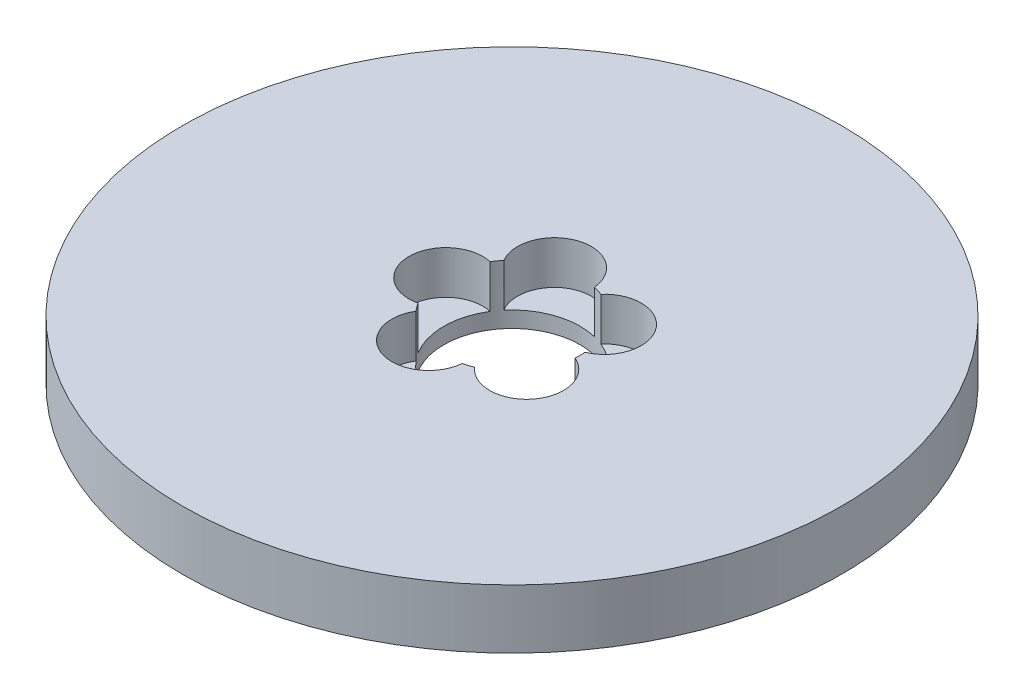
ISO-10303-21;
HEADER;
FILE_DESCRIPTION(('STEP AP214'),'2;1');
FILE_NAME('part.step','',(''),(''),'','','');
FILE_SCHEMA(('AUTOMOTIVE_DESIGN { 1 0 10303 214 1 1 1 1 }'));
ENDSEC;
DATA;
#1=APPLICATION_CONTEXT('core data for automotive mechanical design processes');
#2=APPLICATION_PROTOCOL_DEFINITION('international standard','automotive_design',2000,#1);
#3=PRODUCT_CONTEXT('',#1,'mechanical');
#4=PRODUCT('Part','Part','',(#3));
#5=PRODUCT_RELATED_PRODUCT_CATEGORY('part','',(#4));
#6=PRODUCT_DEFINITION_FORMATION('','',#4);
#7=PRODUCT_DEFINITION_CONTEXT('part definition',#1,'design');
#8=PRODUCT_DEFINITION('design','',#6,#7);
#9=PRODUCT_DEFINITION_SHAPE('','',#8);
#10=(LENGTH_UNIT() NAMED_UNIT(*) SI_UNIT(.MILLI.,.METRE.));
#11=(NAMED_UNIT(*) PLANE_ANGLE_UNIT() SI_UNIT($,.RADIAN.));
#12=(NAMED_UNIT(*) SI_UNIT($,.STERADIAN.) SOLID_ANGLE_UNIT());
#13=UNCERTAINTY_MEASURE_WITH_UNIT(LENGTH_MEASURE(1.E-05),#10,'distance_accuracy_value','');
#14=(GEOMETRIC_REPRESENTATION_CONTEXT(3) GLOBAL_UNCERTAINTY_ASSIGNED_CONTEXT((#13)) GLOBAL_UNIT_ASSIGNED_CONTEXT((#10,
#11,#12)) REPRESENTATION_CONTEXT('',''));
#15=CARTESIAN_POINT('',(0.,0.,0.));
#16=DIRECTION('',(0.,0.,1.));
#17=DIRECTION('',(1.,0.,0.));
#18=AXIS2_PLACEMENT_3D('',#15,#16,#17);
#19=CARTESIAN_POINT('',(0.,13.,0.));
#20=DIRECTION('',(0.,-1.,0.));
#21=DIRECTION('',(0.,0.,-1.));
#22=AXIS2_PLACEMENT_3D('',#19,#20,#21);
#23=CYLINDRICAL_SURFACE('',#22,72.5);
#24=CARTESIAN_POINT('',(0.,13.,0.));
#25=DIRECTION('',(0.,1.,0.));
#26=DIRECTION('',(0.,0.,1.));
#27=AXIS2_PLACEMENT_3D('',#24,#25,#26);
#28=CIRCLE('',#27,72.5);
#29=CARTESIAN_POINT('',(0.,13.,-72.5));
#30=VERTEX_POINT('',#29);
#31=EDGE_CURVE('E157',#30,#30,#28,.T.);
#32=CARTESIAN_POINT('',(0.,0.,0.));
#33=DIRECTION('',(0.,1.,0.));
#34=DIRECTION('',(0.,0.,1.));
#35=AXIS2_PLACEMENT_3D('',#32,#33,#34);
#36=CIRCLE('',#35,72.5);
#37=CARTESIAN_POINT('',(0.,0.,-72.5));
#38=VERTEX_POINT('',#37);
#39=EDGE_CURVE('E150',#38,#38,#36,.T.);
#40=CARTESIAN_POINT('',(0.,13.,-72.5));
#41=CARTESIAN_POINT('',(0.,12.8645833333333,-72.5));
#42=CARTESIAN_POINT('',(0.,12.7291666666667,-72.5));
#43=CARTESIAN_POINT('',(0.,12.4583333333333,-72.5));
#44=CARTESIAN_POINT('',(0.,12.3229166666667,-72.5));
#45=CARTESIAN_POINT('',(0.,12.0520833333333,-72.5));
#46=CARTESIAN_POINT('',(0.,11.9166666666667,-72.5));
#47=CARTESIAN_POINT('',(0.,11.6458333333333,-72.5));
#48=CARTESIAN_POINT('',(0.,11.5104166666667,-72.5));
#49=CARTESIAN_POINT('',(0.,11.2395833333333,-72.5));
#50=CARTESIAN_POINT('',(0.,11.1041666666667,-72.5));
#51=CARTESIAN_POINT('',(0.,10.8333333333333,-72.5));
#52=CARTESIAN_POINT('',(0.,10.6979166666667,-72.5));
#53=CARTESIAN_POINT('',(0.,10.4270833333333,-72.5));
#54=CARTESIAN_POINT('',(0.,10.2916666666667,-72.5));
#55=CARTESIAN_POINT('',(0.,10.0208333333333,-72.5));
#56=CARTESIAN_POINT('',(0.,9.88541666666667,-72.5));
#57=CARTESIAN_POINT('',(0.,9.61458333333333,-72.5));
#58=CARTESIAN_POINT('',(0.,9.47916666666667,-72.5));
#59=CARTESIAN_POINT('',(0.,9.20833333333333,-72.5));
#60=CARTESIAN_POINT('',(0.,9.07291666666666,-72.5));
#61=CARTESIAN_POINT('',(0.,8.80208333333333,-72.5));
#62=CARTESIAN_POINT('',(0.,8.66666666666667,-72.5));
#63=CARTESIAN_POINT('',(0.,8.39583333333333,-72.5));
#64=CARTESIAN_POINT('',(0.,8.26041666666667,-72.5));
#65=CARTESIAN_POINT('',(0.,7.98958333333333,-72.5));
#66=CARTESIAN_POINT('',(0.,7.85416666666667,-72.5));
#67=CARTESIAN_POINT('',(0.,7.58333333333333,-72.5));
#68=CARTESIAN_POINT('',(0.,7.44791666666667,-72.5));
#69=CARTESIAN_POINT('',(0.,7.17708333333333,-72.5));
#70=CARTESIAN_POINT('',(0.,7.04166666666667,-72.5));
#71=CARTESIAN_POINT('',(0.,6.77083333333333,-72.5));
#72=CARTESIAN_POINT('',(0.,6.63541666666667,-72.5));
#73=CARTESIAN_POINT('',(0.,6.36458333333333,-72.5));
#74=CARTESIAN_POINT('',(0.,6.22916666666667,-72.5));
#75=CARTESIAN_POINT('',(0.,5.95833333333333,-72.5));
#76=CARTESIAN_POINT('',(0.,5.82291666666667,-72.5));
#77=CARTESIAN_POINT('',(0.,5.55208333333333,-72.5));
#78=CARTESIAN_POINT('',(0.,5.41666666666667,-72.5));
#79=CARTESIAN_POINT('',(0.,5.14583333333333,-72.5));
#80=CARTESIAN_POINT('',(0.,5.01041666666667,-72.5));
#81=CARTESIAN_POINT('',(0.,4.73958333333333,-72.5));
#82=CARTESIAN_POINT('',(0.,4.60416666666667,-72.5));
#83=CARTESIAN_POINT('',(0.,4.33333333333333,-72.5));
#84=CARTESIAN_POINT('',(0.,4.19791666666667,-72.5));
#85=CARTESIAN_POINT('',(0.,3.92708333333333,-72.5));
#86=CARTESIAN_POINT('',(0.,3.79166666666667,-72.5));
#87=CARTESIAN_POINT('',(0.,3.52083333333333,-72.5));
#88=CARTESIAN_POINT('',(0.,3.38541666666667,-72.5));
#89=CARTESIAN_POINT('',(0.,3.11458333333333,-72.5));
#90=CARTESIAN_POINT('',(0.,2.97916666666667,-72.5));
#91=CARTESIAN_POINT('',(0.,2.70833333333333,-72.5));
#92=CARTESIAN_POINT('',(0.,2.57291666666667,-72.5));
#93=CARTESIAN_POINT('',(0.,2.30208333333333,-72.5));
#94=CARTESIAN_POINT('',(0.,2.16666666666667,-72.5));
#95=CARTESIAN_POINT('',(0.,1.89583333333333,-72.5));
#96=CARTESIAN_POINT('',(0.,1.76041666666667,-72.5));
#97=CARTESIAN_POINT('',(0.,1.48958333333333,-72.5));
#98=CARTESIAN_POINT('',(0.,1.35416666666667,-72.5));
#99=CARTESIAN_POINT('',(0.,1.08333333333333,-72.5));
#100=CARTESIAN_POINT('',(0.,0.947916666666667,-72.5));
#101=CARTESIAN_POINT('',(0.,0.677083333333334,-72.5));
#102=CARTESIAN_POINT('',(0.,0.541666666666667,-72.5));
#103=CARTESIAN_POINT('',(0.,0.270833333333334,-72.5));
#104=CARTESIAN_POINT('',(0.,0.135416666666667,-72.5));
#105=CARTESIAN_POINT('',(0.,0.,-72.5));
#106=B_SPLINE_CURVE_WITH_KNOTS('',3,(#40,#41,#42,#43,#44,#45,#46,#47,#48,#49,#50,#51,#52,#53,
#54,#55,#56,#57,#58,#59,#60,#61,#62,#63,#64,#65,#66,#67,#68,#69,#70,#71,#72,#73,#74,#75,#76,#77,
#78,#79,#80,#81,#82,#83,#84,#85,#86,#87,#88,#89,#90,#91,#92,#93,#94,#95,#96,#97,#98,#99,#100,
#101,#102,#103,#104,#105),.UNSPECIFIED.,.F.,.F.,(4,2,2,2,2,2,2,2,2,2,2,2,2,2,2,2,2,2,2,2,2,2,2,
2,2,2,2,2,2,2,2,2,4),(0.,0.40625,0.812500000000001,1.21875,1.625,2.03125,2.4375,2.84375,3.25,
3.65625,4.0625,4.46875,4.875,5.28125,5.6875,6.09375,6.5,6.90625,7.3125,7.71875,8.125,8.53125,
8.9375,9.34375,9.75,10.15625,10.5625,10.96875,11.375,11.78125,12.1875,12.59375,13.),.UNSPECIFIED.);
#107=EDGE_CURVE('BSEAM39',#30,#38,#106,.T.);
#108=ORIENTED_EDGE('',*,*,#31,.F.);
#109=ORIENTED_EDGE('',*,*,#39,.T.);
#110=ORIENTED_EDGE('',*,*,#107,.T.);
#111=ORIENTED_EDGE('',*,*,#107,.F.);
#112=EDGE_LOOP('',(#108,#110,#109,#111));
#113=FACE_BOUND('',#112,.T.);
#114=ADVANCED_FACE('F39',(#113),#23,.T.);
#115=CARTESIAN_POINT('',(0.,13.,0.));
#116=DIRECTION('',(0.,1.,0.));
#117=DIRECTION('',(0.,0.,1.));
#118=AXIS2_PLACEMENT_3D('',#115,#116,#117);
#119=PLANE('',#118);
#120=CARTESIAN_POINT('',(-4.49469762514531,13.,-13.8332568854899));
#121=DIRECTION('',(0.,1.,0.));
#122=DIRECTION('',(-0.95105651629515,0.,0.309016994374958));
#123=AXIS2_PLACEMENT_3D('',#120,#121,#122);
#124=CIRCLE('',#123,8.11849038893925);
#125=CARTESIAN_POINT('',(3.59085227778288,13.,-14.5638518228916));
#126=VERTEX_POINT('',#125);
#127=CARTESIAN_POINT('',(-11.4654778350851,13.,-9.67175361623595));
#128=VERTEX_POINT('',#127);
#129=EDGE_CURVE('E194',#126,#128,#124,.T.);
#130=ORIENTED_EDGE('',*,*,#129,.F.);
#131=CARTESIAN_POINT('',(0.,13.,0.));
#132=DIRECTION('',(0.,1.,0.));
#133=DIRECTION('',(0.,0.,1.));
#134=AXIS2_PLACEMENT_3D('',#131,#132,#133);
#135=CIRCLE('',#134,15.);
#136=CARTESIAN_POINT('',(5.65535680105188,13.,-13.8930536403195));
#137=VERTEX_POINT('',#136);
#138=EDGE_CURVE('E147',#137,#126,#135,.T.);
#139=ORIENTED_EDGE('',*,*,#138,.F.);
#140=CARTESIAN_POINT('',(11.7672711517834,13.,-8.54942293034139));
#141=DIRECTION('',(0.,1.,0.));
#142=DIRECTION('',(-0.58778525229248,0.,-0.809016994374942));
#143=AXIS2_PLACEMENT_3D('',#140,#141,#142);
#144=CIRCLE('',#143,8.11849038893925);
#145=CARTESIAN_POINT('',(14.960680556643,13.,-1.0853742589933));
#146=VERTEX_POINT('',#145);
#147=EDGE_CURVE('E254',#146,#137,#144,.T.);
#148=ORIENTED_EDGE('',*,*,#147,.F.);
#149=CARTESIAN_POINT('',(14.960680556643,13.,1.08537425899308));
#150=VERTEX_POINT('',#149);
#151=EDGE_CURVE('E144',#150,#146,#135,.T.);
#152=ORIENTED_EDGE('',*,*,#151,.F.);
#153=CARTESIAN_POINT('',(11.7672711517835,13.,8.54942293034122));
#154=DIRECTION('',(0.,1.,0.));
#155=DIRECTION('',(0.587785252292469,0.,-0.809016994374951));
#156=AXIS2_PLACEMENT_3D('',#153,#154,#155);
#157=CIRCLE('',#156,8.11849038893925);
#158=CARTESIAN_POINT('',(5.65535680105208,13.,13.8930536403195));
#159=VERTEX_POINT('',#158);
#160=EDGE_CURVE('E141',#159,#150,#157,.T.);
#161=ORIENTED_EDGE('',*,*,#160,.F.);
#162=CARTESIAN_POINT('',(3.59085227778309,13.,14.5638518228915));
#163=VERTEX_POINT('',#162);
#164=EDGE_CURVE('E134',#163,#159,#135,.T.);
#165=ORIENTED_EDGE('',*,*,#164,.F.);
#166=CARTESIAN_POINT('',(-4.49469762514511,13.,13.8332568854899));
#167=DIRECTION('',(0.,1.,0.));
#168=DIRECTION('',(0.951056516295155,0.,0.309016994374945));
#169=AXIS2_PLACEMENT_3D('',#166,#167,#168);
#170=CIRCLE('',#169,8.11849038893925);
#171=CARTESIAN_POINT('',(-11.4654778350849,13.,9.67175361623611));
#172=VERTEX_POINT('',#171);
#173=EDGE_CURVE('E111',#172,#163,#170,.T.);
#174=ORIENTED_EDGE('',*,*,#173,.F.);
#175=CARTESIAN_POINT('',(-12.7414118003931,13.,7.9155811746709));
#176=VERTEX_POINT('',#175);
#177=EDGE_CURVE('E145',#176,#172,#135,.T.);
#178=ORIENTED_EDGE('',*,*,#177,.F.);
#179=CARTESIAN_POINT('',(-14.5451470532766,13.,0.));
#180=DIRECTION('',(0.,1.,0.));
#181=DIRECTION('',(0.,0.,1.));
#182=AXIS2_PLACEMENT_3D('',#179,#180,#181);
#183=CIRCLE('',#182,8.11849038893925);
#184=CARTESIAN_POINT('',(-12.7414118003931,13.,-7.9155811746709));
#185=VERTEX_POINT('',#184);
#186=EDGE_CURVE('E153',#185,#176,#183,.T.);
#187=ORIENTED_EDGE('',*,*,#186,.F.);
#188=EDGE_CURVE('E146',#128,#185,#135,.T.);
#189=ORIENTED_EDGE('',*,*,#188,.F.);
#190=EDGE_LOOP('',(#130,#139,#148,#152,#161,#165,#174,#178,#187,#189));
#191=FACE_BOUND('',#190,.T.);
#192=ORIENTED_EDGE('',*,*,#31,.T.);
#193=EDGE_LOOP('',(#192));
#194=FACE_BOUND('',#193,.T.);
#195=ADVANCED_FACE('F139',(#191,#194),#119,.T.);
#196=CARTESIAN_POINT('',(0.,0.,0.));
#197=DIRECTION('',(0.,1.,0.));
#198=DIRECTION('',(0.,0.,1.));
#199=AXIS2_PLACEMENT_3D('',#196,#197,#198);
#200=PLANE('',#199);
#201=CARTESIAN_POINT('',(0.,0.,0.));
#202=DIRECTION('',(0.,1.,0.));
#203=DIRECTION('',(0.,0.,1.));
#204=AXIS2_PLACEMENT_3D('',#201,#202,#203);
#205=CIRCLE('',#204,15.);
#206=CARTESIAN_POINT('',(0.,0.,15.));
#207=VERTEX_POINT('',#206);
#208=EDGE_CURVE('E154',#207,#207,#205,.T.);
#209=ORIENTED_EDGE('',*,*,#208,.T.);
#210=EDGE_LOOP('',(#209));
#211=FACE_BOUND('',#210,.T.);
#212=ORIENTED_EDGE('',*,*,#39,.F.);
#213=EDGE_LOOP('',(#212));
#214=FACE_BOUND('',#213,.T.);
#215=ADVANCED_FACE('F213',(#211,#214),#200,.F.);
#216=CARTESIAN_POINT('',(0.,13.,0.));
#217=DIRECTION('',(0.,-1.,0.));
#218=DIRECTION('',(0.,0.,-1.));
#219=AXIS2_PLACEMENT_3D('',#216,#217,#218);
#220=CYLINDRICAL_SURFACE('',#219,15.);
#221=DIRECTION('',(0.,1.,0.));
#222=VECTOR('',#221,1.);
#223=CARTESIAN_POINT('',(3.59085227778288,8.26298259998294,-14.5638518228915));
#224=LINE('',#223,#222);
#225=CARTESIAN_POINT('',(3.59085227778288,3.52596519996587,-14.5638518228916));
#226=VERTEX_POINT('',#225);
#227=EDGE_CURVE('E11',#226,#126,#224,.T.);
#228=ORIENTED_EDGE('',*,*,#227,.F.);
#229=CARTESIAN_POINT('',(0.,3.52596519996587,0.));
#230=DIRECTION('',(0.,1.,0.));
#231=DIRECTION('',(0.,0.,1.));
#232=AXIS2_PLACEMENT_3D('',#229,#230,#231);
#233=CIRCLE('',#232,15.);
#234=CARTESIAN_POINT('',(-11.4654778350851,3.52596519996587,-9.67175361623595));
#235=VERTEX_POINT('',#234);
#236=EDGE_CURVE('E189',#226,#235,#233,.T.);
#237=ORIENTED_EDGE('',*,*,#236,.T.);
#238=DIRECTION('',(0.,1.,0.));
#239=VECTOR('',#238,1.);
#240=CARTESIAN_POINT('',(-11.4654778350851,8.26298259998294,-9.67175361623594));
#241=LINE('',#240,#239);
#242=EDGE_CURVE('E46',#128,#235,#241,.F.);
#243=ORIENTED_EDGE('',*,*,#242,.F.);
#244=ORIENTED_EDGE('',*,*,#188,.T.);
#245=DIRECTION('',(0.,1.,0.));
#246=VECTOR('',#245,1.);
#247=CARTESIAN_POINT('',(-12.7414118003931,8.26298259998294,-7.9155811746709));
#248=LINE('',#247,#246);
#249=CARTESIAN_POINT('',(-12.7414118003931,3.52596519996587,-7.9155811746709));
#250=VERTEX_POINT('',#249);
#251=EDGE_CURVE('E168',#250,#185,#248,.T.);
#252=ORIENTED_EDGE('',*,*,#251,.F.);
#253=CARTESIAN_POINT('',(0.,3.52596519996587,0.));
#254=DIRECTION('',(0.,1.,0.));
#255=DIRECTION('',(0.,0.,1.));
#256=AXIS2_PLACEMENT_3D('',#253,#254,#255);
#257=CIRCLE('',#256,15.);
#258=CARTESIAN_POINT('',(-12.7414118003931,3.52596519996587,7.9155811746709));
#259=VERTEX_POINT('',#258);
#260=EDGE_CURVE('E165',#250,#259,#257,.T.);
#261=ORIENTED_EDGE('',*,*,#260,.T.);
#262=DIRECTION('',(0.,1.,0.));
#263=VECTOR('',#262,1.);
#264=CARTESIAN_POINT('',(-12.7414118003931,8.26298259998294,7.9155811746709));
#265=LINE('',#264,#263);
#266=EDGE_CURVE('E170',#176,#259,#265,.F.);
#267=ORIENTED_EDGE('',*,*,#266,.F.);
#268=ORIENTED_EDGE('',*,*,#177,.T.);
#269=DIRECTION('',(0.,1.,0.));
#270=VECTOR('',#269,1.);
#271=CARTESIAN_POINT('',(-11.4654778350849,8.26298259998294,9.67175361623611));
#272=LINE('',#271,#270);
#273=CARTESIAN_POINT('',(-11.4654778350849,3.52596519996587,9.67175361623611));
#274=VERTEX_POINT('',#273);
#275=EDGE_CURVE('E121',#274,#172,#272,.T.);
#276=ORIENTED_EDGE('',*,*,#275,.F.);
#277=CARTESIAN_POINT('',(0.,3.52596519996587,0.));
#278=DIRECTION('',(0.,1.,0.));
#279=DIRECTION('',(0.,0.,1.));
#280=AXIS2_PLACEMENT_3D('',#277,#278,#279);
#281=CIRCLE('',#280,15.);
#282=CARTESIAN_POINT('',(3.59085227778309,3.52596519996587,14.5638518228915));
#283=VERTEX_POINT('',#282);
#284=EDGE_CURVE('E136',#274,#283,#281,.T.);
#285=ORIENTED_EDGE('',*,*,#284,.T.);
#286=DIRECTION('',(0.,1.,0.));
#287=VECTOR('',#286,1.);
#288=CARTESIAN_POINT('',(3.59085227778309,8.26298259998294,14.5638518228915));
#289=LINE('',#288,#287);
#290=EDGE_CURVE('E117',#163,#283,#289,.F.);
#291=ORIENTED_EDGE('',*,*,#290,.F.);
#292=ORIENTED_EDGE('',*,*,#164,.T.);
#293=DIRECTION('',(0.,1.,0.));
#294=VECTOR('',#293,1.);
#295=CARTESIAN_POINT('',(5.65535680105208,8.26298259998294,13.8930536403195));
#296=LINE('',#295,#294);
#297=CARTESIAN_POINT('',(5.65535680105208,3.52596519996587,13.8930536403195));
#298=VERTEX_POINT('',#297);
#299=EDGE_CURVE('E182',#298,#159,#296,.T.);
#300=ORIENTED_EDGE('',*,*,#299,.F.);
#301=CARTESIAN_POINT('',(0.,3.52596519996587,0.));
#302=DIRECTION('',(0.,1.,0.));
#303=DIRECTION('',(0.,0.,1.));
#304=AXIS2_PLACEMENT_3D('',#301,#302,#303);
#305=CIRCLE('',#304,15.);
#306=CARTESIAN_POINT('',(14.960680556643,3.52596519996587,1.08537425899308));
#307=VERTEX_POINT('',#306);
#308=EDGE_CURVE('E174',#298,#307,#305,.T.);
#309=ORIENTED_EDGE('',*,*,#308,.T.);
#310=DIRECTION('',(0.,1.,0.));
#311=VECTOR('',#310,1.);
#312=CARTESIAN_POINT('',(14.960680556643,8.26298259998294,1.08537425899308));
#313=LINE('',#312,#311);
#314=EDGE_CURVE('E177',#150,#307,#313,.F.);
#315=ORIENTED_EDGE('',*,*,#314,.F.);
#316=ORIENTED_EDGE('',*,*,#151,.T.);
#317=DIRECTION('',(0.,1.,0.));
#318=VECTOR('',#317,1.);
#319=CARTESIAN_POINT('',(14.960680556643,8.26298259998294,-1.0853742589933));
#320=LINE('',#319,#318);
#321=CARTESIAN_POINT('',(14.960680556643,3.52596519996587,-1.0853742589933));
#322=VERTEX_POINT('',#321);
#323=EDGE_CURVE('E187',#322,#146,#320,.T.);
#324=ORIENTED_EDGE('',*,*,#323,.F.);
#325=CARTESIAN_POINT('',(0.,3.52596519996587,0.));
#326=DIRECTION('',(0.,1.,0.));
#327=DIRECTION('',(0.,0.,1.));
#328=AXIS2_PLACEMENT_3D('',#325,#326,#327);
#329=CIRCLE('',#328,15.);
#330=CARTESIAN_POINT('',(5.65535680105188,3.52596519996587,-13.8930536403195));
#331=VERTEX_POINT('',#330);
#332=EDGE_CURVE('E181',#322,#331,#329,.T.);
#333=ORIENTED_EDGE('',*,*,#332,.T.);
#334=DIRECTION('',(0.,1.,0.));
#335=VECTOR('',#334,1.);
#336=CARTESIAN_POINT('',(5.65535680105188,8.26298259998294,-13.8930536403196));
#337=LINE('',#336,#335);
#338=EDGE_CURVE('E186',#137,#331,#337,.F.);
#339=ORIENTED_EDGE('',*,*,#338,.F.);
#340=ORIENTED_EDGE('',*,*,#138,.T.);
#341=EDGE_LOOP('',(#228,#237,#243,#244,#252,#261,#267,#268,#276,#285,#291,#292,#300,#309,#315,
#316,#324,#333,#339,#340));
#342=FACE_BOUND('',#341,.T.);
#343=ORIENTED_EDGE('',*,*,#208,.F.);
#344=EDGE_LOOP('',(#343));
#345=FACE_BOUND('',#344,.T.);
#346=ADVANCED_FACE('F135',(#342,#345),#220,.F.);
#347=CARTESIAN_POINT('',(-14.5451470532766,3.52596519996587,0.));
#348=DIRECTION('',(0.,1.,0.));
#349=DIRECTION('',(0.,0.,1.));
#350=AXIS2_PLACEMENT_3D('',#347,#348,#349);
#351=CYLINDRICAL_SURFACE('',#350,8.11849038893925);
#352=ORIENTED_EDGE('',*,*,#251,.T.);
#353=ORIENTED_EDGE('',*,*,#186,.T.);
#354=ORIENTED_EDGE('',*,*,#266,.T.);
#355=CARTESIAN_POINT('',(-14.5451470532766,3.52596519996587,0.));
#356=DIRECTION('',(0.,1.,0.));
#357=DIRECTION('',(0.,0.,1.));
#358=AXIS2_PLACEMENT_3D('',#355,#356,#357);
#359=CIRCLE('',#358,8.11849038893925);
#360=EDGE_CURVE('E158',#250,#259,#359,.T.);
#361=ORIENTED_EDGE('',*,*,#360,.F.);
#362=EDGE_LOOP('',(#352,#353,#354,#361));
#363=FACE_BOUND('',#362,.T.);
#364=ADVANCED_FACE('F221',(#363),#351,.F.);
#365=CARTESIAN_POINT('',(-14.5451470532766,3.52596519996587,0.));
#366=DIRECTION('',(0.,1.,0.));
#367=DIRECTION('',(0.,0.,1.));
#368=AXIS2_PLACEMENT_3D('',#365,#366,#367);
#369=PLANE('',#368);
#370=ORIENTED_EDGE('',*,*,#360,.T.);
#371=ORIENTED_EDGE('',*,*,#260,.F.);
#372=EDGE_LOOP('',(#370,#371));
#373=FACE_BOUND('',#372,.T.);
#374=ADVANCED_FACE('F227',(#373),#369,.T.);
#375=CARTESIAN_POINT('',(-4.49469762514511,3.52596519996587,13.8332568854899));
#376=DIRECTION('',(0.,1.,0.));
#377=DIRECTION('',(0.,0.,1.));
#378=AXIS2_PLACEMENT_3D('',#375,#376,#377);
#379=CYLINDRICAL_SURFACE('',#378,8.11849038893925);
#380=ORIENTED_EDGE('',*,*,#275,.T.);
#381=ORIENTED_EDGE('',*,*,#173,.T.);
#382=ORIENTED_EDGE('',*,*,#290,.T.);
#383=CARTESIAN_POINT('',(-4.49469762514511,3.52596519996587,13.8332568854899));
#384=DIRECTION('',(0.,1.,0.));
#385=DIRECTION('',(0.951056516295155,0.,0.309016994374945));
#386=AXIS2_PLACEMENT_3D('',#383,#384,#385);
#387=CIRCLE('',#386,8.11849038893925);
#388=EDGE_CURVE('E127',#274,#283,#387,.T.);
#389=ORIENTED_EDGE('',*,*,#388,.F.);
#390=EDGE_LOOP('',(#380,#381,#382,#389));
#391=FACE_BOUND('',#390,.T.);
#392=ADVANCED_FACE('F116',(#391),#379,.F.);
#393=CARTESIAN_POINT('',(-4.49469762514511,3.52596519996587,13.8332568854899));
#394=DIRECTION('',(0.,1.,0.));
#395=DIRECTION('',(0.951056516295155,0.,0.309016994374945));
#396=AXIS2_PLACEMENT_3D('',#393,#394,#395);
#397=PLANE('',#396);
#398=ORIENTED_EDGE('',*,*,#388,.T.);
#399=ORIENTED_EDGE('',*,*,#284,.F.);
#400=EDGE_LOOP('',(#398,#399));
#401=FACE_BOUND('',#400,.T.);
#402=ADVANCED_FACE('F234',(#401),#397,.T.);
#403=CARTESIAN_POINT('',(11.7672711517835,3.52596519996587,8.54942293034122));
#404=DIRECTION('',(0.,1.,0.));
#405=DIRECTION('',(0.,0.,1.));
#406=AXIS2_PLACEMENT_3D('',#403,#404,#405);
#407=CYLINDRICAL_SURFACE('',#406,8.11849038893925);
#408=ORIENTED_EDGE('',*,*,#299,.T.);
#409=ORIENTED_EDGE('',*,*,#160,.T.);
#410=ORIENTED_EDGE('',*,*,#314,.T.);
#411=CARTESIAN_POINT('',(11.7672711517835,3.52596519996587,8.54942293034122));
#412=DIRECTION('',(0.,1.,0.));
#413=DIRECTION('',(0.587785252292469,0.,-0.809016994374951));
#414=AXIS2_PLACEMENT_3D('',#411,#412,#413);
#415=CIRCLE('',#414,8.11849038893925);
#416=EDGE_CURVE('E130',#298,#307,#415,.T.);
#417=ORIENTED_EDGE('',*,*,#416,.F.);
#418=EDGE_LOOP('',(#408,#409,#410,#417));
#419=FACE_BOUND('',#418,.T.);
#420=ADVANCED_FACE('F240',(#419),#407,.F.);
#421=CARTESIAN_POINT('',(11.7672711517835,3.52596519996587,8.54942293034122));
#422=DIRECTION('',(0.,1.,0.));
#423=DIRECTION('',(0.587785252292469,0.,-0.809016994374951));
#424=AXIS2_PLACEMENT_3D('',#421,#422,#423);
#425=PLANE('',#424);
#426=ORIENTED_EDGE('',*,*,#416,.T.);
#427=ORIENTED_EDGE('',*,*,#308,.F.);
#428=EDGE_LOOP('',(#426,#427));
#429=FACE_BOUND('',#428,.T.);
#430=ADVANCED_FACE('F245',(#429),#425,.T.);
#431=CARTESIAN_POINT('',(11.7672711517834,3.52596519996587,-8.54942293034139));
#432=DIRECTION('',(0.,1.,0.));
#433=DIRECTION('',(0.,0.,1.));
#434=AXIS2_PLACEMENT_3D('',#431,#432,#433);
#435=CYLINDRICAL_SURFACE('',#434,8.11849038893925);
#436=ORIENTED_EDGE('',*,*,#323,.T.);
#437=ORIENTED_EDGE('',*,*,#147,.T.);
#438=ORIENTED_EDGE('',*,*,#338,.T.);
#439=CARTESIAN_POINT('',(11.7672711517834,3.52596519996587,-8.54942293034139));
#440=DIRECTION('',(0.,1.,0.));
#441=DIRECTION('',(-0.58778525229248,0.,-0.809016994374942));
#442=AXIS2_PLACEMENT_3D('',#439,#440,#441);
#443=CIRCLE('',#442,8.11849038893925);
#444=EDGE_CURVE('E56',#322,#331,#443,.T.);
#445=ORIENTED_EDGE('',*,*,#444,.F.);
#446=EDGE_LOOP('',(#436,#437,#438,#445));
#447=FACE_BOUND('',#446,.T.);
#448=ADVANCED_FACE('F266',(#447),#435,.F.);
#449=CARTESIAN_POINT('',(11.7672711517834,3.52596519996587,-8.54942293034139));
#450=DIRECTION('',(0.,1.,0.));
#451=DIRECTION('',(-0.58778525229248,0.,-0.809016994374942));
#452=AXIS2_PLACEMENT_3D('',#449,#450,#451);
#453=PLANE('',#452);
#454=ORIENTED_EDGE('',*,*,#444,.T.);
#455=ORIENTED_EDGE('',*,*,#332,.F.);
#456=EDGE_LOOP('',(#454,#455));
#457=FACE_BOUND('',#456,.T.);
#458=ADVANCED_FACE('F204',(#457),#453,.T.);
#459=CARTESIAN_POINT('',(-4.49469762514531,3.52596519996587,-13.8332568854899));
#460=DIRECTION('',(0.,1.,0.));
#461=DIRECTION('',(0.,0.,1.));
#462=AXIS2_PLACEMENT_3D('',#459,#460,#461);
#463=CYLINDRICAL_SURFACE('',#462,8.11849038893925);
#464=ORIENTED_EDGE('',*,*,#227,.T.);
#465=ORIENTED_EDGE('',*,*,#129,.T.);
#466=ORIENTED_EDGE('',*,*,#242,.T.);
#467=CARTESIAN_POINT('',(-4.49469762514531,3.52596519996587,-13.8332568854899));
#468=DIRECTION('',(0.,1.,0.));
#469=DIRECTION('',(-0.95105651629515,0.,0.309016994374958));
#470=AXIS2_PLACEMENT_3D('',#467,#468,#469);
#471=CIRCLE('',#470,8.11849038893925);
#472=EDGE_CURVE('E55',#226,#235,#471,.T.);
#473=ORIENTED_EDGE('',*,*,#472,.F.);
#474=EDGE_LOOP('',(#464,#465,#466,#473));
#475=FACE_BOUND('',#474,.T.);
#476=ADVANCED_FACE('F193',(#475),#463,.F.);
#477=CARTESIAN_POINT('',(-4.49469762514531,3.52596519996587,-13.8332568854899));
#478=DIRECTION('',(0.,1.,0.));
#479=DIRECTION('',(-0.95105651629515,0.,0.309016994374958));
#480=AXIS2_PLACEMENT_3D('',#477,#478,#479);
#481=PLANE('',#480);
#482=ORIENTED_EDGE('',*,*,#472,.T.);
#483=ORIENTED_EDGE('',*,*,#236,.F.);
#484=EDGE_LOOP('',(#482,#483));
#485=FACE_BOUND('',#484,.T.);
#486=ADVANCED_FACE('F196',(#485),#481,.T.);
#487=CLOSED_SHELL('',(#114,#195,#215,#346,#364,#374,#392,#402,#420,#430,#448,#458,#476,#486));
#488=MANIFOLD_SOLID_BREP('B2',#487);
#489=ADVANCED_BREP_SHAPE_REPRESENTATION('',(#18,#488),#14);
#490=SHAPE_DEFINITION_REPRESENTATION(#9,#489);
ENDSEC;
END-ISO-10303-21;
